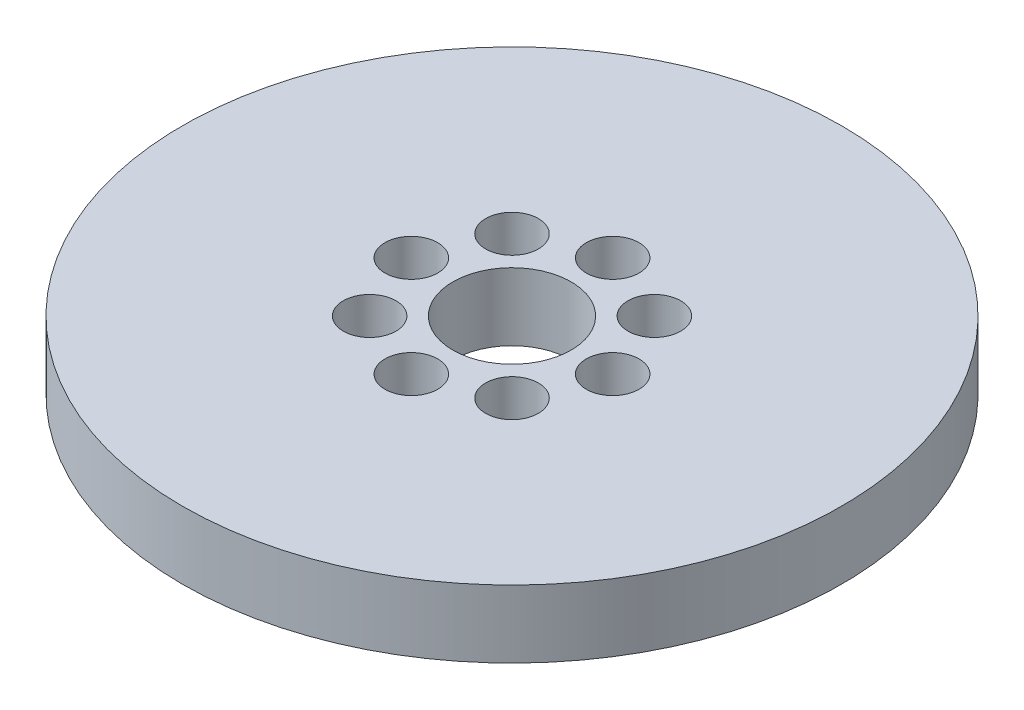
ISO-10303-21;
HEADER;
FILE_DESCRIPTION(('STEP AP214'),'2;1');
FILE_NAME('part.step','',(''),(''),'','','');
FILE_SCHEMA(('AUTOMOTIVE_DESIGN { 1 0 10303 214 1 1 1 1 }'));
ENDSEC;
DATA;
#1=APPLICATION_CONTEXT('core data for automotive mechanical design processes');
#2=APPLICATION_PROTOCOL_DEFINITION('international standard','automotive_design',2000,#1);
#3=PRODUCT_CONTEXT('',#1,'mechanical');
#4=PRODUCT('Part','Part','',(#3));
#5=PRODUCT_RELATED_PRODUCT_CATEGORY('part','',(#4));
#6=PRODUCT_DEFINITION_FORMATION('','',#4);
#7=PRODUCT_DEFINITION_CONTEXT('part definition',#1,'design');
#8=PRODUCT_DEFINITION('design','',#6,#7);
#9=PRODUCT_DEFINITION_SHAPE('','',#8);
#10=(LENGTH_UNIT() NAMED_UNIT(*) SI_UNIT(.MILLI.,.METRE.));
#11=(NAMED_UNIT(*) PLANE_ANGLE_UNIT() SI_UNIT($,.RADIAN.));
#12=(NAMED_UNIT(*) SI_UNIT($,.STERADIAN.) SOLID_ANGLE_UNIT());
#13=UNCERTAINTY_MEASURE_WITH_UNIT(LENGTH_MEASURE(1.E-05),#10,'distance_accuracy_value','');
#14=(GEOMETRIC_REPRESENTATION_CONTEXT(3) GLOBAL_UNCERTAINTY_ASSIGNED_CONTEXT((#13)) GLOBAL_UNIT_ASSIGNED_CONTEXT((#10,
#11,#12)) REPRESENTATION_CONTEXT('',''));
#15=CARTESIAN_POINT('',(0.,0.,0.));
#16=DIRECTION('',(0.,0.,1.));
#17=DIRECTION('',(1.,0.,0.));
#18=AXIS2_PLACEMENT_3D('',#15,#16,#17);
#19=CARTESIAN_POINT('',(0.,20.,0.));
#20=DIRECTION('',(0.,-1.,0.));
#21=DIRECTION('',(0.,0.,-1.));
#22=AXIS2_PLACEMENT_3D('',#19,#20,#21);
#23=CYLINDRICAL_SURFACE('',#22,97.5);
#24=CARTESIAN_POINT('',(0.,20.,0.));
#25=DIRECTION('',(0.,1.,0.));
#26=DIRECTION('',(0.,0.,1.));
#27=AXIS2_PLACEMENT_3D('',#24,#25,#26);
#28=CIRCLE('',#27,97.5);
#29=CARTESIAN_POINT('',(0.,20.,97.5));
#30=VERTEX_POINT('',#29);
#31=EDGE_CURVE('E10',#30,#30,#28,.T.);
#32=ORIENTED_EDGE('',*,*,#31,.F.);
#33=EDGE_LOOP('',(#32));
#34=FACE_BOUND('',#33,.T.);
#35=CARTESIAN_POINT('',(0.,0.,0.));
#36=DIRECTION('',(0.,1.,0.));
#37=DIRECTION('',(0.,0.,1.));
#38=AXIS2_PLACEMENT_3D('',#35,#36,#37);
#39=CIRCLE('',#38,97.5);
#40=CARTESIAN_POINT('',(0.,0.,97.5));
#41=VERTEX_POINT('',#40);
#42=EDGE_CURVE('E37',#41,#41,#39,.T.);
#43=ORIENTED_EDGE('',*,*,#42,.T.);
#44=EDGE_LOOP('',(#43));
#45=FACE_BOUND('',#44,.T.);
#46=ADVANCED_FACE('F40',(#34,#45),#23,.T.);
#47=CARTESIAN_POINT('',(0.,20.,0.));
#48=DIRECTION('',(0.,1.,0.));
#49=DIRECTION('',(0.,0.,1.));
#50=AXIS2_PLACEMENT_3D('',#47,#48,#49);
#51=PLANE('',#50);
#52=CARTESIAN_POINT('',(1.03990156407439E-13,20.,29.7839645455172));
#53=DIRECTION('',(0.,1.,0.));
#54=DIRECTION('',(1.,0.,0.));
#55=AXIS2_PLACEMENT_3D('',#52,#53,#54);
#56=CIRCLE('',#55,7.80222678513482);
#57=CARTESIAN_POINT('',(7.80222678513493,20.,29.7839645455171));
#58=VERTEX_POINT('',#57);
#59=EDGE_CURVE('E88',#58,#58,#56,.T.);
#60=ORIENTED_EDGE('',*,*,#59,.F.);
#61=EDGE_LOOP('',(#60));
#62=FACE_BOUND('',#61,.T.);
#63=CARTESIAN_POINT('',(21.060443300755,20.,21.0604433007548));
#64=DIRECTION('',(0.,1.,0.));
#65=DIRECTION('',(0.707106781186544,0.,-0.707106781186551));
#66=AXIS2_PLACEMENT_3D('',#63,#64,#65);
#67=CIRCLE('',#66,7.80222678513482);
#68=CARTESIAN_POINT('',(26.5774507688791,20.,15.5434358326306));
#69=VERTEX_POINT('',#68);
#70=EDGE_CURVE('E79',#69,#69,#67,.T.);
#71=ORIENTED_EDGE('',*,*,#70,.F.);
#72=EDGE_LOOP('',(#71));
#73=FACE_BOUND('',#72,.T.);
#74=CARTESIAN_POINT('',(29.7839645455172,20.,0.));
#75=DIRECTION('',(0.,1.,0.));
#76=DIRECTION('',(0.,0.,-1.));
#77=AXIS2_PLACEMENT_3D('',#74,#75,#76);
#78=CIRCLE('',#77,7.80222678513482);
#79=CARTESIAN_POINT('',(29.7839645455172,20.,-7.80222678513482));
#80=VERTEX_POINT('',#79);
#81=EDGE_CURVE('E74',#80,#80,#78,.T.);
#82=ORIENTED_EDGE('',*,*,#81,.F.);
#83=EDGE_LOOP('',(#82));
#84=FACE_BOUND('',#83,.T.);
#85=CARTESIAN_POINT('',(21.0604433007547,20.,-21.0604433007551));
#86=DIRECTION('',(0.,1.,0.));
#87=DIRECTION('',(-0.707106781186554,0.,-0.707106781186541));
#88=AXIS2_PLACEMENT_3D('',#85,#86,#87);
#89=CIRCLE('',#88,7.80222678513482);
#90=CARTESIAN_POINT('',(15.5434358326305,20.,-26.5774507688792));
#91=VERTEX_POINT('',#90);
#92=EDGE_CURVE('E70',#91,#91,#89,.T.);
#93=ORIENTED_EDGE('',*,*,#92,.F.);
#94=EDGE_LOOP('',(#93));
#95=FACE_BOUND('',#94,.T.);
#96=CARTESIAN_POINT('',(-3.11970469222316E-13,20.,-29.7839645455172));
#97=DIRECTION('',(0.,1.,0.));
#98=DIRECTION('',(-1.,0.,0.));
#99=AXIS2_PLACEMENT_3D('',#96,#97,#98);
#100=CIRCLE('',#99,7.80222678513482);
#101=CARTESIAN_POINT('',(-7.80222678513513,20.,-29.7839645455171));
#102=VERTEX_POINT('',#101);
#103=EDGE_CURVE('E100',#102,#102,#100,.T.);
#104=ORIENTED_EDGE('',*,*,#103,.F.);
#105=EDGE_LOOP('',(#104));
#106=FACE_BOUND('',#105,.T.);
#107=CARTESIAN_POINT('',(-21.0604433007551,20.,-21.0604433007546));
#108=DIRECTION('',(0.,1.,0.));
#109=DIRECTION('',(-0.707106781186539,0.,0.707106781186556));
#110=AXIS2_PLACEMENT_3D('',#107,#108,#109);
#111=CIRCLE('',#110,7.80222678513482);
#112=CARTESIAN_POINT('',(-26.5774507688792,20.,-15.5434358326304));
#113=VERTEX_POINT('',#112);
#114=EDGE_CURVE('E93',#113,#113,#111,.T.);
#115=ORIENTED_EDGE('',*,*,#114,.F.);
#116=EDGE_LOOP('',(#115));
#117=FACE_BOUND('',#116,.T.);
#118=CARTESIAN_POINT('',(-21.0604433007549,20.,21.0604433007549));
#119=DIRECTION('',(0.,1.,0.));
#120=DIRECTION('',(0.707106781186549,0.,0.707106781186546));
#121=AXIS2_PLACEMENT_3D('',#118,#119,#120);
#122=CIRCLE('',#121,7.80222678513482);
#123=CARTESIAN_POINT('',(-15.5434358326307,20.,26.5774507688791));
#124=VERTEX_POINT('',#123);
#125=EDGE_CURVE('E61',#124,#124,#122,.T.);
#126=ORIENTED_EDGE('',*,*,#125,.F.);
#127=EDGE_LOOP('',(#126));
#128=FACE_BOUND('',#127,.T.);
#129=CARTESIAN_POINT('',(-29.7839645455172,20.,0.));
#130=DIRECTION('',(0.,1.,0.));
#131=DIRECTION('',(0.,0.,1.));
#132=AXIS2_PLACEMENT_3D('',#129,#130,#131);
#133=CIRCLE('',#132,7.80222678513482);
#134=CARTESIAN_POINT('',(-29.7839645455172,20.,7.80222678513482));
#135=VERTEX_POINT('',#134);
#136=EDGE_CURVE('E54',#135,#135,#133,.T.);
#137=ORIENTED_EDGE('',*,*,#136,.F.);
#138=EDGE_LOOP('',(#137));
#139=FACE_BOUND('',#138,.T.);
#140=CARTESIAN_POINT('',(0.,20.,0.));
#141=DIRECTION('',(0.,1.,0.));
#142=DIRECTION('',(0.,0.,1.));
#143=AXIS2_PLACEMENT_3D('',#140,#141,#142);
#144=CIRCLE('',#143,17.5);
#145=CARTESIAN_POINT('',(0.,20.,17.5));
#146=VERTEX_POINT('',#145);
#147=EDGE_CURVE('E50',#146,#146,#144,.T.);
#148=ORIENTED_EDGE('',*,*,#147,.F.);
#149=EDGE_LOOP('',(#148));
#150=FACE_BOUND('',#149,.T.);
#151=ORIENTED_EDGE('',*,*,#31,.T.);
#152=EDGE_LOOP('',(#151));
#153=FACE_BOUND('',#152,.T.);
#154=ADVANCED_FACE('F115',(#62,#73,#84,#95,#106,#117,#128,#139,#150,#153),#51,.T.);
#155=CARTESIAN_POINT('',(0.,0.,0.));
#156=DIRECTION('',(0.,1.,0.));
#157=DIRECTION('',(0.,0.,1.));
#158=AXIS2_PLACEMENT_3D('',#155,#156,#157);
#159=PLANE('',#158);
#160=CARTESIAN_POINT('',(0.,0.,0.));
#161=DIRECTION('',(0.,1.,0.));
#162=DIRECTION('',(0.,0.,1.));
#163=AXIS2_PLACEMENT_3D('',#160,#161,#162);
#164=CIRCLE('',#163,17.5);
#165=CARTESIAN_POINT('',(0.,0.,17.5));
#166=VERTEX_POINT('',#165);
#167=EDGE_CURVE('E47',#166,#166,#164,.T.);
#168=ORIENTED_EDGE('',*,*,#167,.T.);
#169=EDGE_LOOP('',(#168));
#170=FACE_BOUND('',#169,.T.);
#171=ORIENTED_EDGE('',*,*,#42,.F.);
#172=EDGE_LOOP('',(#171));
#173=FACE_BOUND('',#172,.T.);
#174=ADVANCED_FACE('F113',(#170,#173),#159,.F.);
#175=CARTESIAN_POINT('',(0.,20.,0.));
#176=DIRECTION('',(0.,-1.,0.));
#177=DIRECTION('',(0.,0.,-1.));
#178=AXIS2_PLACEMENT_3D('',#175,#176,#177);
#179=CYLINDRICAL_SURFACE('',#178,17.5);
#180=ORIENTED_EDGE('',*,*,#147,.T.);
#181=EDGE_LOOP('',(#180));
#182=FACE_BOUND('',#181,.T.);
#183=ORIENTED_EDGE('',*,*,#167,.F.);
#184=EDGE_LOOP('',(#183));
#185=FACE_BOUND('',#184,.T.);
#186=ADVANCED_FACE('F127',(#182,#185),#179,.F.);
#187=CARTESIAN_POINT('',(-29.7839645455172,4.3411679884572,0.));
#188=DIRECTION('',(0.,1.,0.));
#189=DIRECTION('',(0.,0.,1.));
#190=AXIS2_PLACEMENT_3D('',#187,#188,#189);
#191=CYLINDRICAL_SURFACE('',#190,7.80222678513482);
#192=CARTESIAN_POINT('',(-29.7839645455172,4.3411679884572,0.));
#193=DIRECTION('',(0.,1.,0.));
#194=DIRECTION('',(0.,0.,1.));
#195=AXIS2_PLACEMENT_3D('',#192,#193,#194);
#196=CIRCLE('',#195,7.80222678513482);
#197=CARTESIAN_POINT('',(-29.7839645455172,4.3411679884572,7.80222678513482));
#198=VERTEX_POINT('',#197);
#199=EDGE_CURVE('E55',#198,#198,#196,.T.);
#200=ORIENTED_EDGE('',*,*,#199,.F.);
#201=EDGE_LOOP('',(#200));
#202=FACE_BOUND('',#201,.T.);
#203=ORIENTED_EDGE('',*,*,#136,.T.);
#204=EDGE_LOOP('',(#203));
#205=FACE_BOUND('',#204,.T.);
#206=ADVANCED_FACE('F129',(#202,#205),#191,.F.);
#207=CARTESIAN_POINT('',(-29.7839645455172,4.3411679884572,0.));
#208=DIRECTION('',(0.,1.,0.));
#209=DIRECTION('',(0.,0.,1.));
#210=AXIS2_PLACEMENT_3D('',#207,#208,#209);
#211=PLANE('',#210);
#212=ORIENTED_EDGE('',*,*,#199,.T.);
#213=EDGE_LOOP('',(#212));
#214=FACE_BOUND('',#213,.T.);
#215=ADVANCED_FACE('F157',(#214),#211,.T.);
#216=CARTESIAN_POINT('',(-21.0604433007549,4.3411679884572,21.0604433007549));
#217=DIRECTION('',(0.,1.,0.));
#218=DIRECTION('',(0.,0.,1.));
#219=AXIS2_PLACEMENT_3D('',#216,#217,#218);
#220=CYLINDRICAL_SURFACE('',#219,7.80222678513482);
#221=CARTESIAN_POINT('',(-21.0604433007549,4.3411679884572,21.0604433007549));
#222=DIRECTION('',(0.,1.,0.));
#223=DIRECTION('',(0.707106781186549,0.,0.707106781186546));
#224=AXIS2_PLACEMENT_3D('',#221,#222,#223);
#225=CIRCLE('',#224,7.80222678513482);
#226=CARTESIAN_POINT('',(-15.5434358326307,4.3411679884572,26.5774507688791));
#227=VERTEX_POINT('',#226);
#228=EDGE_CURVE('E59',#227,#227,#225,.T.);
#229=ORIENTED_EDGE('',*,*,#228,.F.);
#230=EDGE_LOOP('',(#229));
#231=FACE_BOUND('',#230,.T.);
#232=ORIENTED_EDGE('',*,*,#125,.T.);
#233=EDGE_LOOP('',(#232));
#234=FACE_BOUND('',#233,.T.);
#235=ADVANCED_FACE('F170',(#231,#234),#220,.F.);
#236=CARTESIAN_POINT('',(-21.0604433007549,4.3411679884572,21.0604433007549));
#237=DIRECTION('',(0.,1.,0.));
#238=DIRECTION('',(0.707106781186549,0.,0.707106781186546));
#239=AXIS2_PLACEMENT_3D('',#236,#237,#238);
#240=PLANE('',#239);
#241=ORIENTED_EDGE('',*,*,#228,.T.);
#242=EDGE_LOOP('',(#241));
#243=FACE_BOUND('',#242,.T.);
#244=ADVANCED_FACE('F182',(#243),#240,.T.);
#245=CARTESIAN_POINT('',(-21.0604433007551,4.3411679884572,-21.0604433007546));
#246=DIRECTION('',(0.,1.,0.));
#247=DIRECTION('',(0.,0.,1.));
#248=AXIS2_PLACEMENT_3D('',#245,#246,#247);
#249=CYLINDRICAL_SURFACE('',#248,7.80222678513482);
#250=CARTESIAN_POINT('',(-21.0604433007551,4.3411679884572,-21.0604433007546));
#251=DIRECTION('',(0.,1.,0.));
#252=DIRECTION('',(-0.707106781186539,0.,0.707106781186556));
#253=AXIS2_PLACEMENT_3D('',#250,#251,#252);
#254=CIRCLE('',#253,7.80222678513482);
#255=CARTESIAN_POINT('',(-26.5774507688792,4.3411679884572,-15.5434358326304));
#256=VERTEX_POINT('',#255);
#257=EDGE_CURVE('E94',#256,#256,#254,.T.);
#258=ORIENTED_EDGE('',*,*,#257,.F.);
#259=EDGE_LOOP('',(#258));
#260=FACE_BOUND('',#259,.T.);
#261=ORIENTED_EDGE('',*,*,#114,.T.);
#262=EDGE_LOOP('',(#261));
#263=FACE_BOUND('',#262,.T.);
#264=ADVANCED_FACE('F189',(#260,#263),#249,.F.);
#265=CARTESIAN_POINT('',(-21.0604433007551,4.3411679884572,-21.0604433007546));
#266=DIRECTION('',(0.,1.,0.));
#267=DIRECTION('',(-0.707106781186539,0.,0.707106781186556));
#268=AXIS2_PLACEMENT_3D('',#265,#266,#267);
#269=PLANE('',#268);
#270=ORIENTED_EDGE('',*,*,#257,.T.);
#271=EDGE_LOOP('',(#270));
#272=FACE_BOUND('',#271,.T.);
#273=ADVANCED_FACE('F107',(#272),#269,.T.);
#274=CARTESIAN_POINT('',(-3.11970469222316E-13,4.3411679884572,-29.7839645455172));
#275=DIRECTION('',(0.,1.,0.));
#276=DIRECTION('',(0.,0.,1.));
#277=AXIS2_PLACEMENT_3D('',#274,#275,#276);
#278=CYLINDRICAL_SURFACE('',#277,7.80222678513482);
#279=CARTESIAN_POINT('',(-3.11970469222316E-13,4.3411679884572,-29.7839645455172));
#280=DIRECTION('',(0.,1.,0.));
#281=DIRECTION('',(-1.,0.,0.));
#282=AXIS2_PLACEMENT_3D('',#279,#280,#281);
#283=CIRCLE('',#282,7.80222678513482);
#284=CARTESIAN_POINT('',(-7.80222678513513,4.3411679884572,-29.7839645455171));
#285=VERTEX_POINT('',#284);
#286=EDGE_CURVE('E72',#285,#285,#283,.T.);
#287=ORIENTED_EDGE('',*,*,#286,.F.);
#288=EDGE_LOOP('',(#287));
#289=FACE_BOUND('',#288,.T.);
#290=ORIENTED_EDGE('',*,*,#103,.T.);
#291=EDGE_LOOP('',(#290));
#292=FACE_BOUND('',#291,.T.);
#293=ADVANCED_FACE('F104',(#289,#292),#278,.F.);
#294=CARTESIAN_POINT('',(-3.11970469222316E-13,4.3411679884572,-29.7839645455172));
#295=DIRECTION('',(0.,1.,0.));
#296=DIRECTION('',(-1.,0.,0.));
#297=AXIS2_PLACEMENT_3D('',#294,#295,#296);
#298=PLANE('',#297);
#299=ORIENTED_EDGE('',*,*,#286,.T.);
#300=EDGE_LOOP('',(#299));
#301=FACE_BOUND('',#300,.T.);
#302=ADVANCED_FACE('F103',(#301),#298,.T.);
#303=CARTESIAN_POINT('',(21.0604433007547,4.3411679884572,-21.0604433007551));
#304=DIRECTION('',(0.,1.,0.));
#305=DIRECTION('',(0.,0.,1.));
#306=AXIS2_PLACEMENT_3D('',#303,#304,#305);
#307=CYLINDRICAL_SURFACE('',#306,7.80222678513482);
#308=CARTESIAN_POINT('',(21.0604433007547,4.3411679884572,-21.0604433007551));
#309=DIRECTION('',(0.,1.,0.));
#310=DIRECTION('',(-0.707106781186554,0.,-0.707106781186541));
#311=AXIS2_PLACEMENT_3D('',#308,#309,#310);
#312=CIRCLE('',#311,7.80222678513482);
#313=CARTESIAN_POINT('',(15.5434358326305,4.3411679884572,-26.5774507688792));
#314=VERTEX_POINT('',#313);
#315=EDGE_CURVE('E69',#314,#314,#312,.T.);
#316=ORIENTED_EDGE('',*,*,#315,.F.);
#317=EDGE_LOOP('',(#316));
#318=FACE_BOUND('',#317,.T.);
#319=ORIENTED_EDGE('',*,*,#92,.T.);
#320=EDGE_LOOP('',(#319));
#321=FACE_BOUND('',#320,.T.);
#322=ADVANCED_FACE('F219',(#318,#321),#307,.F.);
#323=CARTESIAN_POINT('',(21.0604433007547,4.3411679884572,-21.0604433007551));
#324=DIRECTION('',(0.,1.,0.));
#325=DIRECTION('',(-0.707106781186554,0.,-0.707106781186541));
#326=AXIS2_PLACEMENT_3D('',#323,#324,#325);
#327=PLANE('',#326);
#328=ORIENTED_EDGE('',*,*,#315,.T.);
#329=EDGE_LOOP('',(#328));
#330=FACE_BOUND('',#329,.T.);
#331=ADVANCED_FACE('F227',(#330),#327,.T.);
#332=CARTESIAN_POINT('',(29.7839645455172,4.3411679884572,0.));
#333=DIRECTION('',(0.,1.,0.));
#334=DIRECTION('',(0.,0.,1.));
#335=AXIS2_PLACEMENT_3D('',#332,#333,#334);
#336=CYLINDRICAL_SURFACE('',#335,7.80222678513482);
#337=CARTESIAN_POINT('',(29.7839645455172,4.3411679884572,0.));
#338=DIRECTION('',(0.,1.,0.));
#339=DIRECTION('',(0.,0.,-1.));
#340=AXIS2_PLACEMENT_3D('',#337,#338,#339);
#341=CIRCLE('',#340,7.80222678513482);
#342=CARTESIAN_POINT('',(29.7839645455172,4.3411679884572,-7.80222678513482));
#343=VERTEX_POINT('',#342);
#344=EDGE_CURVE('E80',#343,#343,#341,.T.);
#345=ORIENTED_EDGE('',*,*,#344,.F.);
#346=EDGE_LOOP('',(#345));
#347=FACE_BOUND('',#346,.T.);
#348=ORIENTED_EDGE('',*,*,#81,.T.);
#349=EDGE_LOOP('',(#348));
#350=FACE_BOUND('',#349,.T.);
#351=ADVANCED_FACE('F240',(#347,#350),#336,.F.);
#352=CARTESIAN_POINT('',(29.7839645455172,4.3411679884572,0.));
#353=DIRECTION('',(0.,1.,0.));
#354=DIRECTION('',(0.,0.,-1.));
#355=AXIS2_PLACEMENT_3D('',#352,#353,#354);
#356=PLANE('',#355);
#357=ORIENTED_EDGE('',*,*,#344,.T.);
#358=EDGE_LOOP('',(#357));
#359=FACE_BOUND('',#358,.T.);
#360=ADVANCED_FACE('F246',(#359),#356,.T.);
#361=CARTESIAN_POINT('',(21.060443300755,4.3411679884572,21.0604433007548));
#362=DIRECTION('',(0.,1.,0.));
#363=DIRECTION('',(0.,0.,1.));
#364=AXIS2_PLACEMENT_3D('',#361,#362,#363);
#365=CYLINDRICAL_SURFACE('',#364,7.80222678513482);
#366=CARTESIAN_POINT('',(21.060443300755,4.3411679884572,21.0604433007548));
#367=DIRECTION('',(0.,1.,0.));
#368=DIRECTION('',(0.707106781186544,0.,-0.707106781186551));
#369=AXIS2_PLACEMENT_3D('',#366,#367,#368);
#370=CIRCLE('',#369,7.80222678513482);
#371=CARTESIAN_POINT('',(26.5774507688791,4.3411679884572,15.5434358326306));
#372=VERTEX_POINT('',#371);
#373=EDGE_CURVE('E82',#372,#372,#370,.T.);
#374=ORIENTED_EDGE('',*,*,#373,.F.);
#375=EDGE_LOOP('',(#374));
#376=FACE_BOUND('',#375,.T.);
#377=ORIENTED_EDGE('',*,*,#70,.T.);
#378=EDGE_LOOP('',(#377));
#379=FACE_BOUND('',#378,.T.);
#380=ADVANCED_FACE('F254',(#376,#379),#365,.F.);
#381=CARTESIAN_POINT('',(21.060443300755,4.3411679884572,21.0604433007548));
#382=DIRECTION('',(0.,1.,0.));
#383=DIRECTION('',(0.707106781186544,0.,-0.707106781186551));
#384=AXIS2_PLACEMENT_3D('',#381,#382,#383);
#385=PLANE('',#384);
#386=ORIENTED_EDGE('',*,*,#373,.T.);
#387=EDGE_LOOP('',(#386));
#388=FACE_BOUND('',#387,.T.);
#389=ADVANCED_FACE('F262',(#388),#385,.T.);
#390=CARTESIAN_POINT('',(1.03990156407439E-13,4.3411679884572,29.7839645455172));
#391=DIRECTION('',(0.,1.,0.));
#392=DIRECTION('',(0.,0.,1.));
#393=AXIS2_PLACEMENT_3D('',#390,#391,#392);
#394=CYLINDRICAL_SURFACE('',#393,7.80222678513482);
#395=CARTESIAN_POINT('',(1.03990156407439E-13,4.3411679884572,29.7839645455172));
#396=DIRECTION('',(0.,1.,0.));
#397=DIRECTION('',(1.,0.,0.));
#398=AXIS2_PLACEMENT_3D('',#395,#396,#397);
#399=CIRCLE('',#398,7.80222678513482);
#400=CARTESIAN_POINT('',(7.80222678513493,4.3411679884572,29.7839645455171));
#401=VERTEX_POINT('',#400);
#402=EDGE_CURVE('E63',#401,#401,#399,.T.);
#403=ORIENTED_EDGE('',*,*,#402,.F.);
#404=EDGE_LOOP('',(#403));
#405=FACE_BOUND('',#404,.T.);
#406=ORIENTED_EDGE('',*,*,#59,.T.);
#407=EDGE_LOOP('',(#406));
#408=FACE_BOUND('',#407,.T.);
#409=ADVANCED_FACE('F272',(#405,#408),#394,.F.);
#410=CARTESIAN_POINT('',(1.03990156407439E-13,4.3411679884572,29.7839645455172));
#411=DIRECTION('',(0.,1.,0.));
#412=DIRECTION('',(1.,0.,0.));
#413=AXIS2_PLACEMENT_3D('',#410,#411,#412);
#414=PLANE('',#413);
#415=ORIENTED_EDGE('',*,*,#402,.T.);
#416=EDGE_LOOP('',(#415));
#417=FACE_BOUND('',#416,.T.);
#418=ADVANCED_FACE('F285',(#417),#414,.T.);
#419=CLOSED_SHELL('',(#46,#154,#174,#186,#206,#215,#235,#244,#264,#273,#293,#302,#322,#331,#351,
#360,#380,#389,#409,#418));
#420=MANIFOLD_SOLID_BREP('B2',#419);
#421=ADVANCED_BREP_SHAPE_REPRESENTATION('',(#18,#420),#14);
#422=SHAPE_DEFINITION_REPRESENTATION(#9,#421);
ENDSEC;
END-ISO-10303-21;
